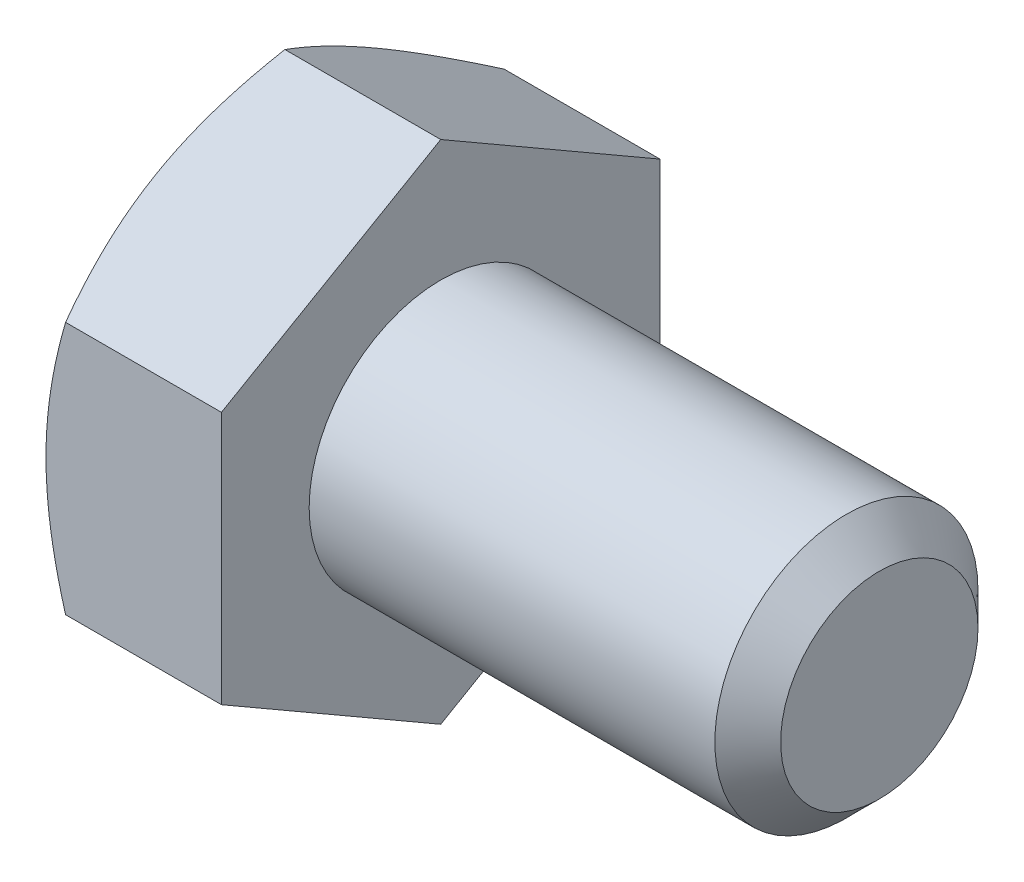
ISO-10303-21;
HEADER;
FILE_DESCRIPTION(('STEP AP214'),'2;1');
FILE_NAME('part.step','',(''),(''),'','','');
FILE_SCHEMA(('AUTOMOTIVE_DESIGN { 1 0 10303 214 1 1 1 1 }'));
ENDSEC;
DATA;
#1=APPLICATION_CONTEXT('core data for automotive mechanical design processes');
#2=APPLICATION_PROTOCOL_DEFINITION('international standard','automotive_design',2000,#1);
#3=PRODUCT_CONTEXT('',#1,'mechanical');
#4=PRODUCT('Part','Part','',(#3));
#5=PRODUCT_RELATED_PRODUCT_CATEGORY('part','',(#4));
#6=PRODUCT_DEFINITION_FORMATION('','',#4);
#7=PRODUCT_DEFINITION_CONTEXT('part definition',#1,'design');
#8=PRODUCT_DEFINITION('design','',#6,#7);
#9=PRODUCT_DEFINITION_SHAPE('','',#8);
#10=(LENGTH_UNIT() NAMED_UNIT(*) SI_UNIT(.MILLI.,.METRE.));
#11=(NAMED_UNIT(*) PLANE_ANGLE_UNIT() SI_UNIT($,.RADIAN.));
#12=(NAMED_UNIT(*) SI_UNIT($,.STERADIAN.) SOLID_ANGLE_UNIT());
#13=UNCERTAINTY_MEASURE_WITH_UNIT(LENGTH_MEASURE(1.E-05),#10,'distance_accuracy_value','');
#14=(GEOMETRIC_REPRESENTATION_CONTEXT(3) GLOBAL_UNCERTAINTY_ASSIGNED_CONTEXT((#13)) GLOBAL_UNIT_ASSIGNED_CONTEXT((#10,
#11,#12)) REPRESENTATION_CONTEXT('',''));
#15=CARTESIAN_POINT('',(0.,0.,0.));
#16=DIRECTION('',(0.,0.,1.));
#17=DIRECTION('',(1.,0.,0.));
#18=AXIS2_PLACEMENT_3D('',#15,#16,#17);
#19=CARTESIAN_POINT('',(-7.,2.88675134594813,-5.));
#20=DIRECTION('',(0.,0.,1.));
#21=DIRECTION('',(0.,-1.,0.));
#22=AXIS2_PLACEMENT_3D('',#19,#20,#21);
#23=PLANE('',#22);
#24=CARTESIAN_POINT('',(-4.50175754060022,-7.8736570188767,-5.));
#25=CARTESIAN_POINT('',(-4.6086809155164,-7.65421637408502,-5.));
#26=CARTESIAN_POINT('',(-4.71461296428865,-7.43428458635668,-5.));
#27=CARTESIAN_POINT('',(-4.92393906972986,-6.99317792778182,-5.));
#28=CARTESIAN_POINT('',(-5.02733274840783,-6.77200287775447,-5.));
#29=CARTESIAN_POINT('',(-5.23152152372065,-6.32706593086417,-5.));
#30=CARTESIAN_POINT('',(-5.33230041218572,-6.10329657096095,-5.));
#31=CARTESIAN_POINT('',(-5.52988978310135,-5.65401907662692,-5.));
#32=CARTESIAN_POINT('',(-5.62670044549487,-5.42851102159105,-5.));
#33=CARTESIAN_POINT('',(-5.81850105982913,-4.96773019079146,-5.));
#34=CARTESIAN_POINT('',(-5.91331851381282,-4.73238523141451,-5.));
#35=CARTESIAN_POINT('',(-6.09606229826897,-4.25898650473719,-5.));
#36=CARTESIAN_POINT('',(-6.18398787255529,-4.02093244346304,-5.));
#37=CARTESIAN_POINT('',(-6.35072723495476,-3.54214478748224,-5.));
#38=CARTESIAN_POINT('',(-6.42955846793331,-3.301417327683,-5.));
#39=CARTESIAN_POINT('',(-6.57565910984207,-2.81651125773827,-5.));
#40=CARTESIAN_POINT('',(-6.64293203520485,-2.5723337217778,-5.));
#41=CARTESIAN_POINT('',(-6.7624103830642,-2.08173956311767,-5.));
#42=CARTESIAN_POINT('',(-6.81470009598878,-1.83534384469814,-5.));
#43=CARTESIAN_POINT('',(-6.90133365164022,-1.33936717869396,-5.));
#44=CARTESIAN_POINT('',(-6.93567944591482,-1.08978658051681,-5.));
#45=CARTESIAN_POINT('',(-6.98324171552744,-0.591994652611079,-5.));
#46=CARTESIAN_POINT('',(-6.99673913454035,-0.343810846499258,-5.));
#47=CARTESIAN_POINT('',(-7.00220795227786,0.152820514821984,-5.));
#48=CARTESIAN_POINT('',(-6.99417903363377,0.401268073866005,-5.));
#49=CARTESIAN_POINT('',(-6.96311999213591,0.819539614676475,-5.));
#50=CARTESIAN_POINT('',(-6.94552930521965,0.98979493404512,-5.));
#51=CARTESIAN_POINT('',(-6.90127081793361,1.32912938793638,-5.));
#52=CARTESIAN_POINT('',(-6.874601885207,1.49820837304531,-5.));
#53=CARTESIAN_POINT('',(-6.78237229170763,2.00341173301729,-5.));
#54=CARTESIAN_POINT('',(-6.70460290714779,2.337335975888,-5.));
#55=CARTESIAN_POINT('',(-6.56883106598622,2.83691487199415,-5.));
#56=CARTESIAN_POINT('',(-6.51971360302846,3.00513229800654,-5.));
#57=CARTESIAN_POINT('',(-6.41615110534967,3.33993504452567,-5.));
#58=CARTESIAN_POINT('',(-6.36170602953136,3.50652035243131,-5.));
#59=CARTESIAN_POINT('',(-6.24838071200455,3.83810926585566,-5.));
#60=CARTESIAN_POINT('',(-6.18950171787467,4.00311330167857,-5.));
#61=CARTESIAN_POINT('',(-6.0680238313771,4.33173746060677,-5.));
#62=CARTESIAN_POINT('',(-6.00542502446627,4.49535761540597,-5.));
#63=CARTESIAN_POINT('',(-5.83201950467007,4.93598294300645,-5.));
#64=CARTESIAN_POINT('',(-5.71826266901745,5.21182602366743,-5.));
#65=CARTESIAN_POINT('',(-5.48405585630304,5.76066658468268,-5.));
#66=CARTESIAN_POINT('',(-5.36360513352739,6.03366374395569,-5.));
#67=CARTESIAN_POINT('',(-5.11759609543004,6.57746623823242,-5.));
#68=CARTESIAN_POINT('',(-4.99203582558467,6.84827068606628,-5.));
#69=CARTESIAN_POINT('',(-4.73703058830432,7.38802449320276,-5.));
#70=CARTESIAN_POINT('',(-4.60758577992801,7.6569739279088,-5.));
#71=CARTESIAN_POINT('',(-4.34544789623686,8.19381940264891,-5.));
#72=CARTESIAN_POINT('',(-4.21274991821137,8.46171304378488,-5.));
#73=CARTESIAN_POINT('',(-3.94493309245098,8.9962880044413,-5.));
#74=CARTESIAN_POINT('',(-3.8098142244533,9.26296931379113,-5.));
#75=CARTESIAN_POINT('',(-3.401627396017,10.0614145317378,-5.));
#76=CARTESIAN_POINT('',(-3.12566969103494,10.5917004378745,-5.));
#77=CARTESIAN_POINT('',(-2.59813067906911,11.5934978261984,-5.));
#78=CARTESIAN_POINT('',(-2.34706534688036,12.0652823432174,-5.));
#79=CARTESIAN_POINT('',(-1.84190825628082,13.0072652089827,-5.));
#80=CARTESIAN_POINT('',(-1.58781631088365,13.4774634574011,-5.));
#81=CARTESIAN_POINT('',(-1.07825272035931,14.4150598997455,-5.));
#82=CARTESIAN_POINT('',(-0.822788602173612,14.8824621908533,-5.));
#83=CARTESIAN_POINT('',(-0.310143937473329,15.8162766578095,-5.));
#84=CARTESIAN_POINT('',(-0.0529635287793573,16.2826889092875,-5.));
#85=CARTESIAN_POINT('',(0.204841560479153,16.7487534511426,-5.));
#86=B_SPLINE_CURVE_WITH_KNOTS('',3,(#24,#25,#26,#27,#28,#29,#30,#31,#32,#33,#34,#35,#36,#37,#38,
#39,#40,#41,#42,#43,#44,#45,#46,#47,#48,#49,#50,#51,#52,#53,#54,#55,#56,#57,#58,#59,#60,#61,#62,
#63,#64,#65,#66,#67,#68,#69,#70,#71,#72,#73,#74,#75,#76,#77,#78,#79,#80,#81,#82,#83,#84,#85),
.UNSPECIFIED.,.F.,.F.,(4,2,2,2,2,2,2,2,2,2,2,2,2,2,2,2,2,2,2,2,2,2,2,2,2,2,2,2,2,2,4),(0.,
0.732320649228782,1.46474969554234,2.20096737715445,2.93715163726605,3.69825037836021,
4.45943251165486,5.21912936588069,5.97859468349108,6.73369963721938,7.48872245001084,
8.23347928786149,8.97824710592677,9.49148539016022,10.0047877156168,11.0318914624583,
11.5575684291884,12.0832494513179,12.6087831104645,13.1343047009664,14.0293094369911,
14.9244140791771,15.819864399481,16.7152781040304,17.612136124032,18.5090016542186,
20.3023290058613,21.9056050637106,23.5089806922305,25.106957271978,26.7048070399876),.UNSPECIFIED.);
#87=CARTESIAN_POINT('',(-6.5534180126148,2.88675134594813,-5.));
#88=VERTEX_POINT('',#87);
#89=CARTESIAN_POINT('',(-7.,0.,-5.));
#90=VERTEX_POINT('',#89);
#91=EDGE_CURVE('E236',#88,#90,#86,.F.);
#92=ORIENTED_EDGE('',*,*,#91,.F.);
#93=DIRECTION('',(1.,0.,0.));
#94=VECTOR('',#93,1.);
#95=CARTESIAN_POINT('',(-7.,2.88675134594813,-5.));
#96=LINE('',#95,#94);
#97=CARTESIAN_POINT('',(-3.,2.88675134594813,-5.));
#98=VERTEX_POINT('',#97);
#99=EDGE_CURVE('E263',#88,#98,#96,.T.);
#100=ORIENTED_EDGE('',*,*,#99,.T.);
#101=DIRECTION('',(0.,-1.,0.));
#102=VECTOR('',#101,1.);
#103=CARTESIAN_POINT('',(-3.,2.88675134594813,-5.));
#104=LINE('',#103,#102);
#105=CARTESIAN_POINT('',(-3.,-2.88675134594813,-5.));
#106=VERTEX_POINT('',#105);
#107=EDGE_CURVE('E242',#98,#106,#104,.T.);
#108=ORIENTED_EDGE('',*,*,#107,.T.);
#109=DIRECTION('',(1.,0.,0.));
#110=VECTOR('',#109,1.);
#111=CARTESIAN_POINT('',(-7.,-2.88675134594813,-5.));
#112=LINE('',#111,#110);
#113=CARTESIAN_POINT('',(-6.5534180126148,-2.88675134594813,-5.));
#114=VERTEX_POINT('',#113);
#115=EDGE_CURVE('E219',#114,#106,#112,.T.);
#116=ORIENTED_EDGE('',*,*,#115,.F.);
#117=EDGE_CURVE('E160',#90,#114,#86,.F.);
#118=ORIENTED_EDGE('',*,*,#117,.F.);
#119=EDGE_LOOP('',(#92,#100,#108,#116,#118));
#120=FACE_BOUND('',#119,.T.);
#121=ADVANCED_FACE('F36',(#120),#23,.F.);
#122=CARTESIAN_POINT('',(-7.,-2.88675134594813,-5.));
#123=DIRECTION('',(0.,0.866025403784439,0.5));
#124=DIRECTION('',(0.,-0.5,0.866025403784439));
#125=AXIS2_PLACEMENT_3D('',#122,#123,#124);
#126=PLANE('',#125);
#127=CARTESIAN_POINT('',(-6.55335134394817,-2.88663587589429,-5.0002));
#128=CARTESIAN_POINT('',(-6.62661343236236,-3.01349970319368,-4.78046540547482));
#129=CARTESIAN_POINT('',(-6.69324867808191,-3.14144859993849,-4.55885141554042));
#130=CARTESIAN_POINT('',(-6.80956100898919,-3.39956193532121,-4.11178600454649));
#131=CARTESIAN_POINT('',(-6.85919695008421,-3.52973095989718,-3.88632664040923));
#132=CARTESIAN_POINT('',(-6.9364489745813,-3.78847564779798,-3.43816769477649));
#133=CARTESIAN_POINT('',(-6.96457962171651,-3.91701101576052,-3.21553790689581));
#134=CARTESIAN_POINT('',(-6.98980507804631,-4.11026620624323,-2.88081009815336));
#135=CARTESIAN_POINT('',(-6.99538654023051,-4.17472868879311,-2.76915780319494));
#136=CARTESIAN_POINT('',(-7.00079778324853,-4.30371322717528,-2.5457500293262));
#137=CARTESIAN_POINT('',(-7.00062774174179,-4.36823528110589,-2.43399455370969));
#138=CARTESIAN_POINT('',(-6.99224636820796,-4.54500768479195,-2.12781576914936));
#139=CARTESIAN_POINT('',(-6.97817022810275,-4.65719946015293,-1.93349391403279));
#140=CARTESIAN_POINT('',(-6.93353474289057,-4.88083840557982,-1.54613989800229));
#141=CARTESIAN_POINT('',(-6.90296013985249,-4.99228478956021,-1.35310909862843));
#142=CARTESIAN_POINT('',(-6.82653150637883,-5.21637431361295,-0.964974657525144));
#143=CARTESIAN_POINT('',(-6.78035362112132,-5.32898917185759,-0.769920001358263));
#144=CARTESIAN_POINT('',(-6.67554820550806,-5.55253939626499,-0.38271965464123));
#145=CARTESIAN_POINT('',(-6.61694529656262,-5.66347762579592,-0.190569004591911));
#146=CARTESIAN_POINT('',(-6.55335134394817,-5.7736181619501,0.000200000000002907));
#147=B_SPLINE_CURVE_WITH_KNOTS('',3,(#127,#128,#129,#130,#131,#132,#133,#134,#135,#136,#137,
#138,#139,#140,#141,#142,#143,#144,#145,#146),.UNSPECIFIED.,.F.,.F.,(4,2,2,2,2,2,2,2,2,4),(0.,
0.792555841363093,1.58701660053334,2.36181537487281,2.74884076077326,3.13585419177295,
3.80962362599679,4.4840172390119,5.17336882348929,5.86136694793726),.UNSPECIFIED.);
#148=CARTESIAN_POINT('',(-7.,-4.33012701892219,-2.5));
#149=VERTEX_POINT('',#148);
#150=EDGE_CURVE('E241',#114,#149,#147,.T.);
#151=ORIENTED_EDGE('',*,*,#150,.F.);
#152=ORIENTED_EDGE('',*,*,#115,.T.);
#153=DIRECTION('',(0.,-0.5,0.866025403784439));
#154=VECTOR('',#153,1.);
#155=CARTESIAN_POINT('',(-3.,-2.88675134594813,-5.));
#156=LINE('',#155,#154);
#157=CARTESIAN_POINT('',(-3.,-5.77350269189626,0.));
#158=VERTEX_POINT('',#157);
#159=EDGE_CURVE('E273',#106,#158,#156,.T.);
#160=ORIENTED_EDGE('',*,*,#159,.T.);
#161=DIRECTION('',(1.,0.,0.));
#162=VECTOR('',#161,1.);
#163=CARTESIAN_POINT('',(-7.,-5.77350269189626,0.));
#164=LINE('',#163,#162);
#165=CARTESIAN_POINT('',(-6.55341801261479,-5.77350269189626,0.));
#166=VERTEX_POINT('',#165);
#167=EDGE_CURVE('E223',#166,#158,#164,.T.);
#168=ORIENTED_EDGE('',*,*,#167,.F.);
#169=EDGE_CURVE('E179',#149,#166,#147,.T.);
#170=ORIENTED_EDGE('',*,*,#169,.F.);
#171=EDGE_LOOP('',(#151,#152,#160,#168,#170));
#172=FACE_BOUND('',#171,.T.);
#173=ADVANCED_FACE('F189',(#172),#126,.F.);
#174=CARTESIAN_POINT('',(-7.,-5.77350269189626,0.));
#175=DIRECTION('',(0.,0.866025403784438,-0.5));
#176=DIRECTION('',(0.,0.5,0.866025403784439));
#177=AXIS2_PLACEMENT_3D('',#174,#175,#176);
#178=PLANE('',#177);
#179=CARTESIAN_POINT('',(-6.55335134394817,-5.7736181619501,-0.000199999999997374));
#180=CARTESIAN_POINT('',(-6.62661343236236,-5.64675433465071,0.219534594525188));
#181=CARTESIAN_POINT('',(-6.69324867808191,-5.5188054379059,0.441148584459583));
#182=CARTESIAN_POINT('',(-6.80956100898919,-5.26069210252318,0.888213995453516));
#183=CARTESIAN_POINT('',(-6.85919695008421,-5.13052307794721,1.11367335959078));
#184=CARTESIAN_POINT('',(-6.9364489745813,-4.87177839004641,1.56183230522351));
#185=CARTESIAN_POINT('',(-6.96457962171651,-4.74324302208387,1.7844620931042));
#186=CARTESIAN_POINT('',(-6.98980507804631,-4.54998783160116,2.11918990184665));
#187=CARTESIAN_POINT('',(-6.99538654023051,-4.48552534905128,2.23084219680506));
#188=CARTESIAN_POINT('',(-7.00079778324853,-4.35654081066911,2.4542499706738));
#189=CARTESIAN_POINT('',(-7.00062774174179,-4.2920187567385,2.56600544629032));
#190=CARTESIAN_POINT('',(-6.99224636820796,-4.11524635305245,2.87218423085064));
#191=CARTESIAN_POINT('',(-6.97817022810275,-4.00305457769146,3.06650608596722));
#192=CARTESIAN_POINT('',(-6.93353474289056,-3.77941563226458,3.45386010199771));
#193=CARTESIAN_POINT('',(-6.90296013985249,-3.66796924828419,3.64689090137157));
#194=CARTESIAN_POINT('',(-6.82653150637883,-3.44387972423144,4.03502534247486));
#195=CARTESIAN_POINT('',(-6.78035362112132,-3.3312648659868,4.23007999864174));
#196=CARTESIAN_POINT('',(-6.67554820550806,-3.10771464157941,4.61728034535877));
#197=CARTESIAN_POINT('',(-6.61694529656262,-2.99677641204847,4.80943099540809));
#198=CARTESIAN_POINT('',(-6.55335134394817,-2.88663587589429,5.0002));
#199=B_SPLINE_CURVE_WITH_KNOTS('',3,(#179,#180,#181,#182,#183,#184,#185,#186,#187,#188,#189,
#190,#191,#192,#193,#194,#195,#196,#197,#198),.UNSPECIFIED.,.F.,.F.,(4,2,2,2,2,2,2,2,2,4),(0.,
0.792555841363091,1.58701660053334,2.36181537487281,2.74884076077326,3.13585419177295,
3.80962362599679,4.48401723901189,5.17336882348929,5.86136694793726),.UNSPECIFIED.);
#200=CARTESIAN_POINT('',(-7.,-4.33012701892219,2.5));
#201=VERTEX_POINT('',#200);
#202=EDGE_CURVE('E177',#166,#201,#199,.T.);
#203=ORIENTED_EDGE('',*,*,#202,.F.);
#204=ORIENTED_EDGE('',*,*,#167,.T.);
#205=DIRECTION('',(0.,0.5,0.866025403784438));
#206=VECTOR('',#205,1.);
#207=CARTESIAN_POINT('',(-3.,-5.77350269189626,0.));
#208=LINE('',#207,#206);
#209=CARTESIAN_POINT('',(-3.,-2.88675134594813,5.));
#210=VERTEX_POINT('',#209);
#211=EDGE_CURVE('E256',#158,#210,#208,.T.);
#212=ORIENTED_EDGE('',*,*,#211,.T.);
#213=DIRECTION('',(1.,0.,0.));
#214=VECTOR('',#213,1.);
#215=CARTESIAN_POINT('',(-7.,-2.88675134594813,5.));
#216=LINE('',#215,#214);
#217=CARTESIAN_POINT('',(-6.55341801261495,-2.88675134594836,5.));
#218=VERTEX_POINT('',#217);
#219=EDGE_CURVE('E253',#218,#210,#216,.T.);
#220=ORIENTED_EDGE('',*,*,#219,.F.);
#221=EDGE_CURVE('E171',#201,#218,#199,.T.);
#222=ORIENTED_EDGE('',*,*,#221,.F.);
#223=EDGE_LOOP('',(#203,#204,#212,#220,#222));
#224=FACE_BOUND('',#223,.T.);
#225=ADVANCED_FACE('F185',(#224),#178,.F.);
#226=CARTESIAN_POINT('',(-7.,-2.88675134594813,5.));
#227=DIRECTION('',(0.,0.,-1.));
#228=DIRECTION('',(-1.,0.,0.));
#229=AXIS2_PLACEMENT_3D('',#226,#227,#228);
#230=PLANE('',#229);
#231=CARTESIAN_POINT('',(-4.50175754060022,-7.8736570188767,5.));
#232=CARTESIAN_POINT('',(-4.6086809155164,-7.65421637408502,5.));
#233=CARTESIAN_POINT('',(-4.71461296428865,-7.43428458635667,5.));
#234=CARTESIAN_POINT('',(-4.92393906972986,-6.99317792778182,5.));
#235=CARTESIAN_POINT('',(-5.02733274840782,-6.77200287775447,5.));
#236=CARTESIAN_POINT('',(-5.23152152372065,-6.32706593086417,5.));
#237=CARTESIAN_POINT('',(-5.33230041218572,-6.10329657096095,5.));
#238=CARTESIAN_POINT('',(-5.52988978310135,-5.65401907662692,5.));
#239=CARTESIAN_POINT('',(-5.62670044549486,-5.42851102159105,5.));
#240=CARTESIAN_POINT('',(-5.81850105982913,-4.96773019079146,5.));
#241=CARTESIAN_POINT('',(-5.91331851381282,-4.73238523141451,5.));
#242=CARTESIAN_POINT('',(-6.09606229826897,-4.25898650473719,5.));
#243=CARTESIAN_POINT('',(-6.18398787255529,-4.02093244346304,5.));
#244=CARTESIAN_POINT('',(-6.35072723495476,-3.54214478748224,5.));
#245=CARTESIAN_POINT('',(-6.42955846793331,-3.30141732768299,5.));
#246=CARTESIAN_POINT('',(-6.57565910984207,-2.81651125773826,5.));
#247=CARTESIAN_POINT('',(-6.64293203520484,-2.5723337217778,5.));
#248=CARTESIAN_POINT('',(-6.7624103830642,-2.08173956311767,5.));
#249=CARTESIAN_POINT('',(-6.81470009598878,-1.83534384469814,5.));
#250=CARTESIAN_POINT('',(-6.90133365164022,-1.33936717869395,5.));
#251=CARTESIAN_POINT('',(-6.93567944591482,-1.08978658051681,5.));
#252=CARTESIAN_POINT('',(-6.98324171552744,-0.591994652611077,5.));
#253=CARTESIAN_POINT('',(-6.99673913454035,-0.343810846499256,5.));
#254=CARTESIAN_POINT('',(-7.00220795227786,0.152820514821985,5.));
#255=CARTESIAN_POINT('',(-6.99417903363377,0.401268073866006,5.));
#256=CARTESIAN_POINT('',(-6.96311999213591,0.819539614676477,5.));
#257=CARTESIAN_POINT('',(-6.94552930521965,0.989794934045122,5.));
#258=CARTESIAN_POINT('',(-6.90127081793361,1.32912938793638,5.));
#259=CARTESIAN_POINT('',(-6.874601885207,1.49820837304531,5.));
#260=CARTESIAN_POINT('',(-6.78237229170763,2.00341173301729,5.));
#261=CARTESIAN_POINT('',(-6.70460290714779,2.337335975888,5.));
#262=CARTESIAN_POINT('',(-6.56883106598622,2.83691487199415,5.));
#263=CARTESIAN_POINT('',(-6.51971360302846,3.00513229800654,5.));
#264=CARTESIAN_POINT('',(-6.41615110534967,3.33993504452567,5.));
#265=CARTESIAN_POINT('',(-6.36170602953136,3.50652035243131,5.));
#266=CARTESIAN_POINT('',(-6.24838071200455,3.83810926585566,5.));
#267=CARTESIAN_POINT('',(-6.18950171787467,4.00311330167857,5.));
#268=CARTESIAN_POINT('',(-6.0680238313771,4.33173746060677,5.));
#269=CARTESIAN_POINT('',(-6.00542502446627,4.49535761540597,5.));
#270=CARTESIAN_POINT('',(-5.83201950467007,4.93598294300645,5.));
#271=CARTESIAN_POINT('',(-5.71826266901745,5.21182602366743,5.));
#272=CARTESIAN_POINT('',(-5.48405585630304,5.76066658468268,5.));
#273=CARTESIAN_POINT('',(-5.36360513352739,6.03366374395569,5.));
#274=CARTESIAN_POINT('',(-5.11759609543004,6.57746623823242,5.));
#275=CARTESIAN_POINT('',(-4.99203582558467,6.84827068606628,5.));
#276=CARTESIAN_POINT('',(-4.73703058830432,7.38802449320276,5.));
#277=CARTESIAN_POINT('',(-4.60758577992801,7.6569739279088,5.));
#278=CARTESIAN_POINT('',(-4.34544789623686,8.19381940264891,5.));
#279=CARTESIAN_POINT('',(-4.21274991821137,8.46171304378487,5.));
#280=CARTESIAN_POINT('',(-3.94493309245098,8.9962880044413,5.));
#281=CARTESIAN_POINT('',(-3.8098142244533,9.26296931379113,5.));
#282=CARTESIAN_POINT('',(-3.401627396017,10.0614145317378,5.));
#283=CARTESIAN_POINT('',(-3.12566969103494,10.5917004378745,5.));
#284=CARTESIAN_POINT('',(-2.59813067906911,11.5934978261984,5.));
#285=CARTESIAN_POINT('',(-2.34706534688037,12.0652823432174,5.));
#286=CARTESIAN_POINT('',(-1.84190825628082,13.0072652089827,5.));
#287=CARTESIAN_POINT('',(-1.58781631088366,13.4774634574011,5.));
#288=CARTESIAN_POINT('',(-1.0782527203593,14.4150598997455,5.));
#289=CARTESIAN_POINT('',(-0.822788602173611,14.8824621908533,5.));
#290=CARTESIAN_POINT('',(-0.310143937473328,15.8162766578095,5.));
#291=CARTESIAN_POINT('',(-0.0529635287793561,16.2826889092875,5.));
#292=CARTESIAN_POINT('',(0.204841560479153,16.7487534511426,5.));
#293=B_SPLINE_CURVE_WITH_KNOTS('',3,(#231,#232,#233,#234,#235,#236,#237,#238,#239,#240,#241,
#242,#243,#244,#245,#246,#247,#248,#249,#250,#251,#252,#253,#254,#255,#256,#257,#258,#259,#260,
#261,#262,#263,#264,#265,#266,#267,#268,#269,#270,#271,#272,#273,#274,#275,#276,#277,#278,#279,
#280,#281,#282,#283,#284,#285,#286,#287,#288,#289,#290,#291,#292),.UNSPECIFIED.,.F.,.F.,(4,2,2,
2,2,2,2,2,2,2,2,2,2,2,2,2,2,2,2,2,2,2,2,2,2,2,2,2,2,2,4),(0.,0.732320649228782,1.46474969554234,
2.20096737715445,2.93715163726605,3.69825037836021,4.45943251165486,5.2191293658807,
5.97859468349108,6.73369963721938,7.48872245001084,8.23347928786149,8.97824710592677,
9.49148539016022,10.0047877156168,11.0318914624583,11.5575684291884,12.0832494513179,
12.6087831104645,13.1343047009664,14.0293094369911,14.9244140791771,15.819864399481,
16.7152781040304,17.612136124032,18.5090016542186,20.3023290058613,21.9056050637106,
23.5089806922305,25.106957271978,26.7048070399876),.UNSPECIFIED.);
#294=CARTESIAN_POINT('',(-7.,0.,5.));
#295=VERTEX_POINT('',#294);
#296=EDGE_CURVE('E178',#218,#295,#293,.T.);
#297=ORIENTED_EDGE('',*,*,#296,.F.);
#298=ORIENTED_EDGE('',*,*,#219,.T.);
#299=DIRECTION('',(0.,1.,0.));
#300=VECTOR('',#299,1.);
#301=CARTESIAN_POINT('',(-3.,-2.88675134594813,5.));
#302=LINE('',#301,#300);
#303=CARTESIAN_POINT('',(-3.,2.88675134594813,5.));
#304=VERTEX_POINT('',#303);
#305=EDGE_CURVE('E270',#210,#304,#302,.T.);
#306=ORIENTED_EDGE('',*,*,#305,.T.);
#307=DIRECTION('',(1.,0.,0.));
#308=VECTOR('',#307,1.);
#309=CARTESIAN_POINT('',(-7.,2.88675134594813,5.));
#310=LINE('',#309,#308);
#311=CARTESIAN_POINT('',(-6.5534180126148,2.88675134594813,5.));
#312=VERTEX_POINT('',#311);
#313=EDGE_CURVE('E258',#312,#304,#310,.T.);
#314=ORIENTED_EDGE('',*,*,#313,.F.);
#315=EDGE_CURVE('E108',#295,#312,#293,.T.);
#316=ORIENTED_EDGE('',*,*,#315,.F.);
#317=EDGE_LOOP('',(#297,#298,#306,#314,#316));
#318=FACE_BOUND('',#317,.T.);
#319=ADVANCED_FACE('F188',(#318),#230,.F.);
#320=CARTESIAN_POINT('',(-7.,2.88675134594813,5.));
#321=DIRECTION('',(0.,-0.866025403784439,-0.5));
#322=DIRECTION('',(0.,0.5,-0.866025403784439));
#323=AXIS2_PLACEMENT_3D('',#320,#321,#322);
#324=PLANE('',#323);
#325=CARTESIAN_POINT('',(-6.55335134394817,2.88663587589429,5.0002));
#326=CARTESIAN_POINT('',(-6.62661343236236,3.01349970319368,4.78046540547482));
#327=CARTESIAN_POINT('',(-6.69324867808191,3.14144859993849,4.55885141554042));
#328=CARTESIAN_POINT('',(-6.80956100898919,3.39956193532121,4.11178600454649));
#329=CARTESIAN_POINT('',(-6.85919695008421,3.52973095989718,3.88632664040923));
#330=CARTESIAN_POINT('',(-6.9364489745813,3.78847564779798,3.43816769477649));
#331=CARTESIAN_POINT('',(-6.96457962171651,3.91701101576052,3.21553790689581));
#332=CARTESIAN_POINT('',(-6.98980507804631,4.11026620624322,2.88081009815336));
#333=CARTESIAN_POINT('',(-6.99538654023052,4.17472868879311,2.76915780319494));
#334=CARTESIAN_POINT('',(-7.00079778324853,4.30371322717528,2.5457500293262));
#335=CARTESIAN_POINT('',(-7.00062774174179,4.36823528110589,2.43399455370969));
#336=CARTESIAN_POINT('',(-6.99224636820796,4.54500768479194,2.12781576914936));
#337=CARTESIAN_POINT('',(-6.97817022810275,4.65719946015293,1.93349391403279));
#338=CARTESIAN_POINT('',(-6.93353474289057,4.88083840557981,1.54613989800229));
#339=CARTESIAN_POINT('',(-6.90296013985249,4.9922847895602,1.35310909862843));
#340=CARTESIAN_POINT('',(-6.82653150637883,5.21637431361295,0.964974657525145));
#341=CARTESIAN_POINT('',(-6.78035362112132,5.32898917185759,0.769920001358264));
#342=CARTESIAN_POINT('',(-6.67554820550806,5.55253939626498,0.382719654641231));
#343=CARTESIAN_POINT('',(-6.61694529656262,5.66347762579592,0.190569004591913));
#344=CARTESIAN_POINT('',(-6.55335134394817,5.7736181619501,-0.00020000000000114));
#345=B_SPLINE_CURVE_WITH_KNOTS('',3,(#325,#326,#327,#328,#329,#330,#331,#332,#333,#334,#335,
#336,#337,#338,#339,#340,#341,#342,#343,#344),.UNSPECIFIED.,.F.,.F.,(4,2,2,2,2,2,2,2,2,4),(0.,
0.792555841363092,1.58701660053334,2.36181537487281,2.74884076077326,3.13585419177295,
3.8096236259968,4.4840172390119,5.17336882348929,5.86136694793726),.UNSPECIFIED.);
#346=CARTESIAN_POINT('',(-7.,4.33012701892219,2.5));
#347=VERTEX_POINT('',#346);
#348=EDGE_CURVE('E105',#312,#347,#345,.T.);
#349=ORIENTED_EDGE('',*,*,#348,.F.);
#350=ORIENTED_EDGE('',*,*,#313,.T.);
#351=DIRECTION('',(0.,0.5,-0.866025403784439));
#352=VECTOR('',#351,1.);
#353=CARTESIAN_POINT('',(-3.,2.88675134594813,5.));
#354=LINE('',#353,#352);
#355=CARTESIAN_POINT('',(-3.,5.77350269189626,0.));
#356=VERTEX_POINT('',#355);
#357=EDGE_CURVE('E268',#304,#356,#354,.T.);
#358=ORIENTED_EDGE('',*,*,#357,.T.);
#359=DIRECTION('',(1.,0.,0.));
#360=VECTOR('',#359,1.);
#361=CARTESIAN_POINT('',(-7.,5.77350269189626,0.));
#362=LINE('',#361,#360);
#363=CARTESIAN_POINT('',(-6.5534180126148,5.77350269189626,0.));
#364=VERTEX_POINT('',#363);
#365=EDGE_CURVE('E129',#364,#356,#362,.T.);
#366=ORIENTED_EDGE('',*,*,#365,.F.);
#367=EDGE_CURVE('E112',#347,#364,#345,.T.);
#368=ORIENTED_EDGE('',*,*,#367,.F.);
#369=EDGE_LOOP('',(#349,#350,#358,#366,#368));
#370=FACE_BOUND('',#369,.T.);
#371=ADVANCED_FACE('F127',(#370),#324,.F.);
#372=CARTESIAN_POINT('',(-7.,5.77350269189626,0.));
#373=DIRECTION('',(0.,-0.866025403784439,0.5));
#374=DIRECTION('',(0.,-0.5,-0.866025403784439));
#375=AXIS2_PLACEMENT_3D('',#372,#373,#374);
#376=PLANE('',#375);
#377=CARTESIAN_POINT('',(-6.55335134394817,5.7736181619501,0.000199999999999017));
#378=CARTESIAN_POINT('',(-6.62661343236236,5.64675433465071,-0.219534594525187));
#379=CARTESIAN_POINT('',(-6.69324867808191,5.5188054379059,-0.441148584459582));
#380=CARTESIAN_POINT('',(-6.80956100898919,5.26069210252318,-0.888213995453515));
#381=CARTESIAN_POINT('',(-6.85919695008421,5.13052307794721,-1.11367335959078));
#382=CARTESIAN_POINT('',(-6.9364489745813,4.87177839004641,-1.56183230522351));
#383=CARTESIAN_POINT('',(-6.96457962171651,4.74324302208387,-1.78446209310419));
#384=CARTESIAN_POINT('',(-6.98980507804631,4.54998783160116,-2.11918990184664));
#385=CARTESIAN_POINT('',(-6.99538654023052,4.48552534905128,-2.23084219680506));
#386=CARTESIAN_POINT('',(-7.00079778324853,4.35654081066911,-2.4542499706738));
#387=CARTESIAN_POINT('',(-7.00062774174179,4.2920187567385,-2.56600544629032));
#388=CARTESIAN_POINT('',(-6.99224636820796,4.11524635305244,-2.87218423085064));
#389=CARTESIAN_POINT('',(-6.97817022810275,4.00305457769146,-3.06650608596722));
#390=CARTESIAN_POINT('',(-6.93353474289057,3.77941563226457,-3.45386010199771));
#391=CARTESIAN_POINT('',(-6.90296013985249,3.66796924828418,-3.64689090137157));
#392=CARTESIAN_POINT('',(-6.82653150637883,3.44387972423144,-4.03502534247486));
#393=CARTESIAN_POINT('',(-6.78035362112132,3.3312648659868,-4.23007999864174));
#394=CARTESIAN_POINT('',(-6.67554820550806,3.1077146415794,-4.61728034535877));
#395=CARTESIAN_POINT('',(-6.61694529656262,2.99677641204847,-4.80943099540809));
#396=CARTESIAN_POINT('',(-6.55335134394817,2.88663587589429,-5.0002));
#397=B_SPLINE_CURVE_WITH_KNOTS('',3,(#377,#378,#379,#380,#381,#382,#383,#384,#385,#386,#387,
#388,#389,#390,#391,#392,#393,#394,#395,#396),.UNSPECIFIED.,.F.,.F.,(4,2,2,2,2,2,2,2,2,4),(0.,
0.792555841363092,1.58701660053334,2.36181537487281,2.74884076077326,3.13585419177295,
3.80962362599679,4.48401723901189,5.17336882348929,5.86136694793725),.UNSPECIFIED.);
#398=CARTESIAN_POINT('',(-7.,4.3301270189222,-2.5));
#399=VERTEX_POINT('',#398);
#400=EDGE_CURVE('E118',#364,#399,#397,.T.);
#401=ORIENTED_EDGE('',*,*,#400,.F.);
#402=ORIENTED_EDGE('',*,*,#365,.T.);
#403=DIRECTION('',(0.,-0.5,-0.866025403784439));
#404=VECTOR('',#403,1.);
#405=CARTESIAN_POINT('',(-3.,5.77350269189626,0.));
#406=LINE('',#405,#404);
#407=EDGE_CURVE('E265',#356,#98,#406,.T.);
#408=ORIENTED_EDGE('',*,*,#407,.T.);
#409=ORIENTED_EDGE('',*,*,#99,.F.);
#410=EDGE_CURVE('E124',#399,#88,#397,.T.);
#411=ORIENTED_EDGE('',*,*,#410,.F.);
#412=EDGE_LOOP('',(#401,#402,#408,#409,#411));
#413=FACE_BOUND('',#412,.T.);
#414=ADVANCED_FACE('F204',(#413),#376,.F.);
#415=CARTESIAN_POINT('',(-3.,0.,0.));
#416=DIRECTION('',(1.,0.,0.));
#417=DIRECTION('',(0.,0.,-1.));
#418=AXIS2_PLACEMENT_3D('',#415,#416,#417);
#419=CYLINDRICAL_SURFACE('',#418,3.);
#420=CARTESIAN_POINT('',(6.25,0.,0.));
#421=DIRECTION('',(1.,0.,0.));
#422=DIRECTION('',(0.,0.,-1.));
#423=AXIS2_PLACEMENT_3D('',#420,#421,#422);
#424=CIRCLE('',#423,3.);
#425=CARTESIAN_POINT('',(6.25,0.,-3.));
#426=VERTEX_POINT('',#425);
#427=EDGE_CURVE('E213',#426,#426,#424,.F.);
#428=ORIENTED_EDGE('',*,*,#427,.T.);
#429=EDGE_LOOP('',(#428));
#430=FACE_BOUND('',#429,.T.);
#431=CARTESIAN_POINT('',(-3.,0.,0.));
#432=DIRECTION('',(-1.,0.,0.));
#433=DIRECTION('',(0.,0.,1.));
#434=AXIS2_PLACEMENT_3D('',#431,#432,#433);
#435=CIRCLE('',#434,3.);
#436=CARTESIAN_POINT('',(-3.,0.,3.));
#437=VERTEX_POINT('',#436);
#438=EDGE_CURVE('E216',#437,#437,#435,.F.);
#439=ORIENTED_EDGE('',*,*,#438,.T.);
#440=EDGE_LOOP('',(#439));
#441=FACE_BOUND('',#440,.T.);
#442=ADVANCED_FACE('F201',(#430,#441),#419,.T.);
#443=CARTESIAN_POINT('',(7.,0.,0.));
#444=DIRECTION('',(1.,0.,0.));
#445=DIRECTION('',(0.,0.,-1.));
#446=AXIS2_PLACEMENT_3D('',#443,#444,#445);
#447=PLANE('',#446);
#448=CARTESIAN_POINT('',(7.,0.,0.));
#449=DIRECTION('',(1.,0.,0.));
#450=DIRECTION('',(0.,0.,-1.));
#451=AXIS2_PLACEMENT_3D('',#448,#449,#450);
#452=CIRCLE('',#451,2.25);
#453=CARTESIAN_POINT('',(7.,0.,-2.25));
#454=VERTEX_POINT('',#453);
#455=EDGE_CURVE('E218',#454,#454,#452,.T.);
#456=ORIENTED_EDGE('',*,*,#455,.T.);
#457=EDGE_LOOP('',(#456));
#458=FACE_BOUND('',#457,.T.);
#459=ADVANCED_FACE('F199',(#458),#447,.T.);
#460=CARTESIAN_POINT('',(7.,0.,0.));
#461=DIRECTION('',(-1.,0.,0.));
#462=DIRECTION('',(0.,0.,1.));
#463=AXIS2_PLACEMENT_3D('',#460,#461,#462);
#464=CONICAL_SURFACE('',#463,2.25,0.785398163397446);
#465=ORIENTED_EDGE('',*,*,#427,.F.);
#466=EDGE_LOOP('',(#465));
#467=FACE_BOUND('',#466,.T.);
#468=ORIENTED_EDGE('',*,*,#455,.F.);
#469=EDGE_LOOP('',(#468));
#470=FACE_BOUND('',#469,.T.);
#471=ADVANCED_FACE('F38',(#467,#470),#464,.T.);
#472=CARTESIAN_POINT('',(-3.,-2.88675134594813,-5.));
#473=DIRECTION('',(-1.,0.,0.));
#474=DIRECTION('',(0.,0.,1.));
#475=AXIS2_PLACEMENT_3D('',#472,#473,#474);
#476=PLANE('',#475);
#477=ORIENTED_EDGE('',*,*,#438,.F.);
#478=EDGE_LOOP('',(#477));
#479=FACE_BOUND('',#478,.T.);
#480=ORIENTED_EDGE('',*,*,#107,.F.);
#481=ORIENTED_EDGE('',*,*,#407,.F.);
#482=ORIENTED_EDGE('',*,*,#357,.F.);
#483=ORIENTED_EDGE('',*,*,#305,.F.);
#484=ORIENTED_EDGE('',*,*,#211,.F.);
#485=ORIENTED_EDGE('',*,*,#159,.F.);
#486=EDGE_LOOP('',(#480,#481,#482,#483,#484,#485));
#487=FACE_BOUND('',#486,.T.);
#488=ADVANCED_FACE('F279',(#479,#487),#476,.F.);
#489=CARTESIAN_POINT('',(-7.,0.,0.));
#490=DIRECTION('',(1.,0.,0.));
#491=DIRECTION('',(0.,0.,1.));
#492=AXIS2_PLACEMENT_3D('',#489,#490,#491);
#493=CONICAL_SURFACE('',#492,5.,1.0471975511966);
#494=ORIENTED_EDGE('',*,*,#221,.T.);
#495=ORIENTED_EDGE('',*,*,#296,.T.);
#496=CARTESIAN_POINT('',(-7.,0.,0.));
#497=DIRECTION('',(-1.,0.,0.));
#498=DIRECTION('',(0.,0.,1.));
#499=AXIS2_PLACEMENT_3D('',#496,#497,#498);
#500=CIRCLE('',#499,5.);
#501=EDGE_CURVE('E40',#201,#295,#500,.T.);
#502=ORIENTED_EDGE('',*,*,#501,.F.);
#503=EDGE_LOOP('',(#494,#495,#502));
#504=FACE_BOUND('',#503,.T.);
#505=ADVANCED_FACE('F248',(#504),#493,.T.);
#506=ORIENTED_EDGE('',*,*,#169,.T.);
#507=ORIENTED_EDGE('',*,*,#202,.T.);
#508=EDGE_CURVE('E226',#149,#201,#500,.T.);
#509=ORIENTED_EDGE('',*,*,#508,.F.);
#510=EDGE_LOOP('',(#506,#507,#509));
#511=FACE_BOUND('',#510,.T.);
#512=ADVANCED_FACE('F245',(#511),#493,.T.);
#513=ORIENTED_EDGE('',*,*,#117,.T.);
#514=ORIENTED_EDGE('',*,*,#150,.T.);
#515=EDGE_CURVE('E227',#90,#149,#500,.T.);
#516=ORIENTED_EDGE('',*,*,#515,.F.);
#517=EDGE_LOOP('',(#513,#514,#516));
#518=FACE_BOUND('',#517,.T.);
#519=ADVANCED_FACE('F154',(#518),#493,.T.);
#520=ORIENTED_EDGE('',*,*,#91,.T.);
#521=EDGE_CURVE('E45',#399,#90,#500,.T.);
#522=ORIENTED_EDGE('',*,*,#521,.F.);
#523=ORIENTED_EDGE('',*,*,#410,.T.);
#524=EDGE_LOOP('',(#520,#522,#523));
#525=FACE_BOUND('',#524,.T.);
#526=ADVANCED_FACE('F150',(#525),#493,.T.);
#527=ORIENTED_EDGE('',*,*,#367,.T.);
#528=ORIENTED_EDGE('',*,*,#400,.T.);
#529=EDGE_CURVE('E12',#347,#399,#500,.T.);
#530=ORIENTED_EDGE('',*,*,#529,.F.);
#531=EDGE_LOOP('',(#527,#528,#530));
#532=FACE_BOUND('',#531,.T.);
#533=ADVANCED_FACE('F116',(#532),#493,.T.);
#534=ORIENTED_EDGE('',*,*,#315,.T.);
#535=ORIENTED_EDGE('',*,*,#348,.T.);
#536=CARTESIAN_POINT('',(-7.,0.,0.));
#537=DIRECTION('',(-1.,0.,0.));
#538=DIRECTION('',(0.,0.,1.));
#539=AXIS2_PLACEMENT_3D('',#536,#537,#538);
#540=CIRCLE('',#539,5.);
#541=EDGE_CURVE('E52',#295,#347,#540,.T.);
#542=ORIENTED_EDGE('',*,*,#541,.F.);
#543=EDGE_LOOP('',(#534,#535,#542));
#544=FACE_BOUND('',#543,.T.);
#545=ADVANCED_FACE('F106',(#544),#493,.T.);
#546=CARTESIAN_POINT('',(-7.,-2.88675134594813,-5.));
#547=DIRECTION('',(-1.,0.,0.));
#548=DIRECTION('',(0.,0.,1.));
#549=AXIS2_PLACEMENT_3D('',#546,#547,#548);
#550=PLANE('',#549);
#551=ORIENTED_EDGE('',*,*,#501,.T.);
#552=ORIENTED_EDGE('',*,*,#541,.T.);
#553=ORIENTED_EDGE('',*,*,#529,.T.);
#554=ORIENTED_EDGE('',*,*,#521,.T.);
#555=ORIENTED_EDGE('',*,*,#515,.T.);
#556=ORIENTED_EDGE('',*,*,#508,.T.);
#557=EDGE_LOOP('',(#551,#552,#553,#554,#555,#556));
#558=FACE_BOUND('',#557,.T.);
#559=ADVANCED_FACE('F121',(#558),#550,.T.);
#560=CLOSED_SHELL('',(#121,#173,#225,#319,#371,#414,#442,#459,#471,#488,#505,#512,#519,#526,
#533,#545,#559));
#561=MANIFOLD_SOLID_BREP('B2',#560);
#562=ADVANCED_BREP_SHAPE_REPRESENTATION('',(#18,#561),#14);
#563=SHAPE_DEFINITION_REPRESENTATION(#9,#562);
ENDSEC;
END-ISO-10303-21;
